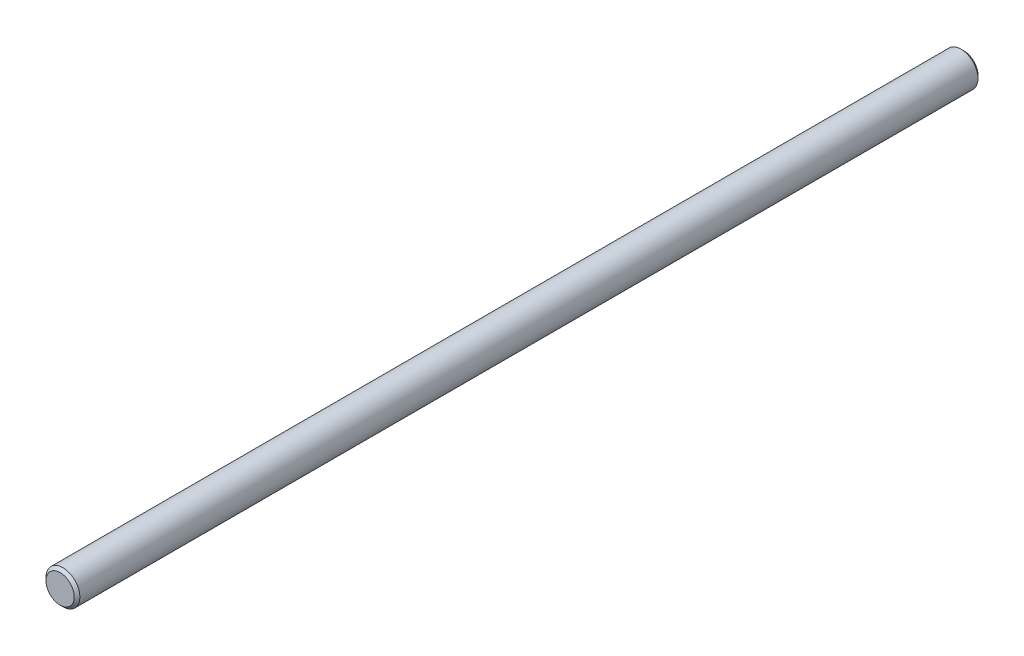
ISO-10303-21;
HEADER;
FILE_DESCRIPTION(('STEP AP214'),'2;1');
FILE_NAME('part.step','',(''),(''),'','','');
FILE_SCHEMA(('AUTOMOTIVE_DESIGN { 1 0 10303 214 1 1 1 1 }'));
ENDSEC;
DATA;
#1=APPLICATION_CONTEXT('core data for automotive mechanical design processes');
#2=APPLICATION_PROTOCOL_DEFINITION('international standard','automotive_design',2000,#1);
#3=PRODUCT_CONTEXT('',#1,'mechanical');
#4=PRODUCT('Part','Part','',(#3));
#5=PRODUCT_RELATED_PRODUCT_CATEGORY('part','',(#4));
#6=PRODUCT_DEFINITION_FORMATION('','',#4);
#7=PRODUCT_DEFINITION_CONTEXT('part definition',#1,'design');
#8=PRODUCT_DEFINITION('design','',#6,#7);
#9=PRODUCT_DEFINITION_SHAPE('','',#8);
#10=(LENGTH_UNIT() NAMED_UNIT(*) SI_UNIT(.MILLI.,.METRE.));
#11=(NAMED_UNIT(*) PLANE_ANGLE_UNIT() SI_UNIT($,.RADIAN.));
#12=(NAMED_UNIT(*) SI_UNIT($,.STERADIAN.) SOLID_ANGLE_UNIT());
#13=UNCERTAINTY_MEASURE_WITH_UNIT(LENGTH_MEASURE(1.E-05),#10,'distance_accuracy_value','');
#14=(GEOMETRIC_REPRESENTATION_CONTEXT(3) GLOBAL_UNCERTAINTY_ASSIGNED_CONTEXT((#13)) GLOBAL_UNIT_ASSIGNED_CONTEXT((#10,
#11,#12)) REPRESENTATION_CONTEXT('',''));
#15=CARTESIAN_POINT('',(0.,0.,0.));
#16=DIRECTION('',(0.,0.,1.));
#17=DIRECTION('',(1.,0.,0.));
#18=AXIS2_PLACEMENT_3D('',#15,#16,#17);
#19=CARTESIAN_POINT('',(0.,3.62077124931057,-160.));
#20=DIRECTION('',(0.,0.,1.));
#21=DIRECTION('',(-1.,0.,0.));
#22=AXIS2_PLACEMENT_3D('',#19,#20,#21);
#23=CYLINDRICAL_SURFACE('',#22,3.);
#24=CARTESIAN_POINT('',(0.,3.62077124931057,-0.500000000000056));
#25=DIRECTION('',(0.,0.,1.));
#26=DIRECTION('',(1.,0.,0.));
#27=AXIS2_PLACEMENT_3D('',#24,#25,#26);
#28=CIRCLE('',#27,3.);
#29=CARTESIAN_POINT('',(3.,3.62077124931057,-0.500000000000056));
#30=VERTEX_POINT('',#29);
#31=EDGE_CURVE('E46',#30,#30,#28,.T.);
#32=ORIENTED_EDGE('',*,*,#31,.F.);
#33=EDGE_LOOP('',(#32));
#34=FACE_BOUND('',#33,.T.);
#35=CARTESIAN_POINT('',(0.,3.62077124931057,-159.5));
#36=DIRECTION('',(0.,0.,1.));
#37=DIRECTION('',(1.,0.,0.));
#38=AXIS2_PLACEMENT_3D('',#35,#36,#37);
#39=CIRCLE('',#38,3.);
#40=CARTESIAN_POINT('',(3.,3.62077124931057,-159.5));
#41=VERTEX_POINT('',#40);
#42=EDGE_CURVE('E50',#41,#41,#39,.F.);
#43=ORIENTED_EDGE('',*,*,#42,.F.);
#44=EDGE_LOOP('',(#43));
#45=FACE_BOUND('',#44,.T.);
#46=ADVANCED_FACE('F39',(#34,#45),#23,.T.);
#47=CARTESIAN_POINT('',(0.,3.62077124931057,-160.));
#48=DIRECTION('',(0.,0.,-1.));
#49=DIRECTION('',(1.,0.,0.));
#50=AXIS2_PLACEMENT_3D('',#47,#48,#49);
#51=PLANE('',#50);
#52=CARTESIAN_POINT('',(0.,3.62077124931057,-160.));
#53=DIRECTION('',(0.,0.,1.));
#54=DIRECTION('',(1.,0.,0.));
#55=AXIS2_PLACEMENT_3D('',#52,#53,#54);
#56=CIRCLE('',#55,2.49999999999999);
#57=CARTESIAN_POINT('',(2.49999999999999,3.62077124931057,-160.));
#58=VERTEX_POINT('',#57);
#59=EDGE_CURVE('E54',#58,#58,#56,.T.);
#60=ORIENTED_EDGE('',*,*,#59,.F.);
#61=EDGE_LOOP('',(#60));
#62=FACE_BOUND('',#61,.T.);
#63=ADVANCED_FACE('F62',(#62),#51,.T.);
#64=CARTESIAN_POINT('',(0.,3.62077124931057,0.));
#65=DIRECTION('',(0.,0.,-1.));
#66=DIRECTION('',(1.,0.,0.));
#67=AXIS2_PLACEMENT_3D('',#64,#65,#66);
#68=PLANE('',#67);
#69=CARTESIAN_POINT('',(0.,3.62077124931057,0.));
#70=DIRECTION('',(0.,0.,1.));
#71=DIRECTION('',(1.,0.,0.));
#72=AXIS2_PLACEMENT_3D('',#69,#70,#71);
#73=CIRCLE('',#72,2.49999999999996);
#74=CARTESIAN_POINT('',(2.49999999999996,3.62077124931057,0.));
#75=VERTEX_POINT('',#74);
#76=EDGE_CURVE('E10',#75,#75,#73,.F.);
#77=ORIENTED_EDGE('',*,*,#76,.F.);
#78=EDGE_LOOP('',(#77));
#79=FACE_BOUND('',#78,.T.);
#80=ADVANCED_FACE('F64',(#79),#68,.F.);
#81=CARTESIAN_POINT('',(0.,3.62077124931057,-160.));
#82=DIRECTION('',(0.,0.,1.));
#83=DIRECTION('',(-1.,0.,0.));
#84=AXIS2_PLACEMENT_3D('',#81,#82,#83);
#85=CONICAL_SURFACE('',#84,2.49999999999999,0.785398163397432);
#86=ORIENTED_EDGE('',*,*,#42,.T.);
#87=EDGE_LOOP('',(#86));
#88=FACE_BOUND('',#87,.T.);
#89=ORIENTED_EDGE('',*,*,#59,.T.);
#90=EDGE_LOOP('',(#89));
#91=FACE_BOUND('',#90,.T.);
#92=ADVANCED_FACE('F60',(#88,#91),#85,.T.);
#93=CARTESIAN_POINT('',(0.,3.62077124931057,-0.500000000000056));
#94=DIRECTION('',(0.,0.,-1.));
#95=DIRECTION('',(1.,0.,0.));
#96=AXIS2_PLACEMENT_3D('',#93,#94,#95);
#97=CONICAL_SURFACE('',#96,3.,0.785398163397432);
#98=ORIENTED_EDGE('',*,*,#76,.T.);
#99=EDGE_LOOP('',(#98));
#100=FACE_BOUND('',#99,.T.);
#101=ORIENTED_EDGE('',*,*,#31,.T.);
#102=EDGE_LOOP('',(#101));
#103=FACE_BOUND('',#102,.T.);
#104=ADVANCED_FACE('F41',(#100,#103),#97,.T.);
#105=CLOSED_SHELL('',(#46,#63,#80,#92,#104));
#106=MANIFOLD_SOLID_BREP('B2',#105);
#107=ADVANCED_BREP_SHAPE_REPRESENTATION('',(#18,#106),#14);
#108=SHAPE_DEFINITION_REPRESENTATION(#9,#107);
ENDSEC;
END-ISO-10303-21;
